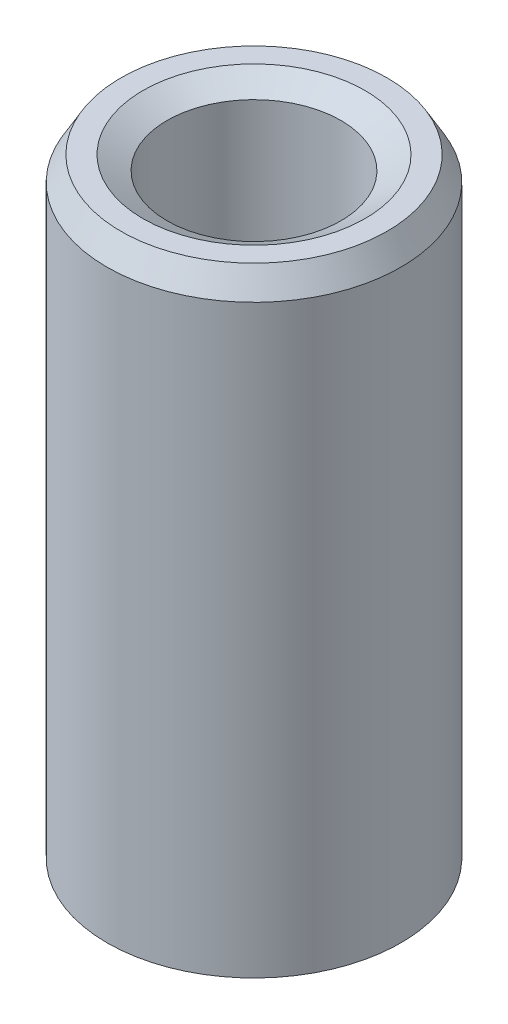
ISO-10303-21;
HEADER;
FILE_DESCRIPTION(('STEP AP214'),'2;1');
FILE_NAME('part.step','',(''),(''),'','','');
FILE_SCHEMA(('AUTOMOTIVE_DESIGN { 1 0 10303 214 1 1 1 1 }'));
ENDSEC;
DATA;
#1=APPLICATION_CONTEXT('core data for automotive mechanical design processes');
#2=APPLICATION_PROTOCOL_DEFINITION('international standard','automotive_design',2000,#1);
#3=PRODUCT_CONTEXT('',#1,'mechanical');
#4=PRODUCT('Part','Part','',(#3));
#5=PRODUCT_RELATED_PRODUCT_CATEGORY('part','',(#4));
#6=PRODUCT_DEFINITION_FORMATION('','',#4);
#7=PRODUCT_DEFINITION_CONTEXT('part definition',#1,'design');
#8=PRODUCT_DEFINITION('design','',#6,#7);
#9=PRODUCT_DEFINITION_SHAPE('','',#8);
#10=(LENGTH_UNIT() NAMED_UNIT(*) SI_UNIT(.MILLI.,.METRE.));
#11=(NAMED_UNIT(*) PLANE_ANGLE_UNIT() SI_UNIT($,.RADIAN.));
#12=(NAMED_UNIT(*) SI_UNIT($,.STERADIAN.) SOLID_ANGLE_UNIT());
#13=UNCERTAINTY_MEASURE_WITH_UNIT(LENGTH_MEASURE(1.E-05),#10,'distance_accuracy_value','');
#14=(GEOMETRIC_REPRESENTATION_CONTEXT(3) GLOBAL_UNCERTAINTY_ASSIGNED_CONTEXT((#13)) GLOBAL_UNIT_ASSIGNED_CONTEXT((#10,
#11,#12)) REPRESENTATION_CONTEXT('',''));
#15=CARTESIAN_POINT('',(0.,0.,0.));
#16=DIRECTION('',(0.,0.,1.));
#17=DIRECTION('',(1.,0.,0.));
#18=AXIS2_PLACEMENT_3D('',#15,#16,#17);
#19=CARTESIAN_POINT('',(0.,74.2111872431679,0.));
#20=DIRECTION('',(0.,-1.,0.));
#21=DIRECTION('',(0.,0.,-1.));
#22=AXIS2_PLACEMENT_3D('',#19,#20,#21);
#23=CYLINDRICAL_SURFACE('',#22,17.5);
#24=CARTESIAN_POINT('',(0.,1.65583119187547,0.));
#25=DIRECTION('',(0.,1.,0.));
#26=DIRECTION('',(0.,0.,1.));
#27=AXIS2_PLACEMENT_3D('',#24,#25,#26);
#28=CIRCLE('',#27,17.5);
#29=CARTESIAN_POINT('',(0.,1.65583119187547,17.5));
#30=VERTEX_POINT('',#29);
#31=EDGE_CURVE('E10',#30,#30,#28,.T.);
#32=ORIENTED_EDGE('',*,*,#31,.T.);
#33=EDGE_LOOP('',(#32));
#34=FACE_BOUND('',#33,.T.);
#35=CARTESIAN_POINT('',(0.,71.3432034900822,0.));
#36=DIRECTION('',(0.,1.,0.));
#37=DIRECTION('',(0.,0.,1.));
#38=AXIS2_PLACEMENT_3D('',#35,#36,#37);
#39=CIRCLE('',#38,17.5);
#40=CARTESIAN_POINT('',(0.,71.3432034900822,-17.5));
#41=VERTEX_POINT('',#40);
#42=EDGE_CURVE('E50',#41,#41,#39,.F.);
#43=ORIENTED_EDGE('',*,*,#42,.T.);
#44=EDGE_LOOP('',(#43));
#45=FACE_BOUND('',#44,.T.);
#46=ADVANCED_FACE('F39',(#34,#45),#23,.T.);
#47=CARTESIAN_POINT('',(0.,74.2111872431679,0.));
#48=DIRECTION('',(0.,1.,0.));
#49=DIRECTION('',(0.,0.,1.));
#50=AXIS2_PLACEMENT_3D('',#47,#48,#49);
#51=PLANE('',#50);
#52=CARTESIAN_POINT('',(0.,74.2111872431679,0.));
#53=DIRECTION('',(0.,1.,0.));
#54=DIRECTION('',(0.,0.,1.));
#55=AXIS2_PLACEMENT_3D('',#52,#53,#54);
#56=CIRCLE('',#55,13.2239791089831);
#57=CARTESIAN_POINT('',(0.,74.2111872431679,13.2239791089831));
#58=VERTEX_POINT('',#57);
#59=EDGE_CURVE('E58',#58,#58,#56,.F.);
#60=ORIENTED_EDGE('',*,*,#59,.T.);
#61=EDGE_LOOP('',(#60));
#62=FACE_BOUND('',#61,.T.);
#63=CARTESIAN_POINT('',(0.,74.2111872431679,0.));
#64=DIRECTION('',(0.,1.,0.));
#65=DIRECTION('',(0.,0.,1.));
#66=AXIS2_PLACEMENT_3D('',#63,#64,#65);
#67=CIRCLE('',#66,15.8441688081245);
#68=CARTESIAN_POINT('',(0.,74.2111872431679,-15.8441688081245));
#69=VERTEX_POINT('',#68);
#70=EDGE_CURVE('E61',#69,#69,#67,.T.);
#71=ORIENTED_EDGE('',*,*,#70,.T.);
#72=EDGE_LOOP('',(#71));
#73=FACE_BOUND('',#72,.T.);
#74=ADVANCED_FACE('F88',(#62,#73),#51,.T.);
#75=CARTESIAN_POINT('',(0.,0.,0.));
#76=DIRECTION('',(0.,1.,0.));
#77=DIRECTION('',(0.,0.,1.));
#78=AXIS2_PLACEMENT_3D('',#75,#76,#77);
#79=PLANE('',#78);
#80=CARTESIAN_POINT('',(0.,0.,0.));
#81=DIRECTION('',(0.,1.,0.));
#82=DIRECTION('',(0.,0.,1.));
#83=AXIS2_PLACEMENT_3D('',#80,#81,#82);
#84=CIRCLE('',#83,12.0118265477729);
#85=CARTESIAN_POINT('',(0.,0.,12.0118265477729));
#86=VERTEX_POINT('',#85);
#87=EDGE_CURVE('E51',#86,#86,#84,.T.);
#88=ORIENTED_EDGE('',*,*,#87,.T.);
#89=EDGE_LOOP('',(#88));
#90=FACE_BOUND('',#89,.T.);
#91=CARTESIAN_POINT('',(0.,0.,0.));
#92=DIRECTION('',(0.,1.,0.));
#93=DIRECTION('',(0.,0.,1.));
#94=AXIS2_PLACEMENT_3D('',#91,#92,#93);
#95=CIRCLE('',#94,14.6320162469143);
#96=CARTESIAN_POINT('',(0.,0.,14.6320162469143));
#97=VERTEX_POINT('',#96);
#98=EDGE_CURVE('E54',#97,#97,#95,.F.);
#99=ORIENTED_EDGE('',*,*,#98,.T.);
#100=EDGE_LOOP('',(#99));
#101=FACE_BOUND('',#100,.T.);
#102=ADVANCED_FACE('F83',(#90,#101),#79,.F.);
#103=CARTESIAN_POINT('',(0.,74.2111872431679,0.));
#104=DIRECTION('',(0.,-1.,0.));
#105=DIRECTION('',(0.,0.,-1.));
#106=AXIS2_PLACEMENT_3D('',#103,#104,#105);
#107=CYLINDRICAL_SURFACE('',#106,10.3559953558974);
#108=CARTESIAN_POINT('',(0.,72.5553560512925,0.));
#109=DIRECTION('',(0.,1.,0.));
#110=DIRECTION('',(0.,0.,1.));
#111=AXIS2_PLACEMENT_3D('',#108,#109,#110);
#112=CIRCLE('',#111,10.3559953558974);
#113=CARTESIAN_POINT('',(0.,72.5553560512925,10.3559953558974));
#114=VERTEX_POINT('',#113);
#115=EDGE_CURVE('E67',#114,#114,#112,.T.);
#116=ORIENTED_EDGE('',*,*,#115,.T.);
#117=EDGE_LOOP('',(#116));
#118=FACE_BOUND('',#117,.T.);
#119=CARTESIAN_POINT('',(0.,2.86798375308568,0.));
#120=DIRECTION('',(0.,1.,0.));
#121=DIRECTION('',(0.,0.,1.));
#122=AXIS2_PLACEMENT_3D('',#119,#120,#121);
#123=CIRCLE('',#122,10.3559953558974);
#124=CARTESIAN_POINT('',(0.,2.86798375308568,10.3559953558974));
#125=VERTEX_POINT('',#124);
#126=EDGE_CURVE('E69',#125,#125,#123,.F.);
#127=ORIENTED_EDGE('',*,*,#126,.T.);
#128=EDGE_LOOP('',(#127));
#129=FACE_BOUND('',#128,.T.);
#130=ADVANCED_FACE('F71',(#118,#129),#107,.F.);
#131=CARTESIAN_POINT('',(0.,72.5553560512925,0.));
#132=DIRECTION('',(0.,1.,0.));
#133=DIRECTION('',(0.,0.,1.));
#134=AXIS2_PLACEMENT_3D('',#131,#132,#133);
#135=CONICAL_SURFACE('',#134,10.3559953558974,1.0471975511966);
#136=ORIENTED_EDGE('',*,*,#59,.F.);
#137=EDGE_LOOP('',(#136));
#138=FACE_BOUND('',#137,.T.);
#139=ORIENTED_EDGE('',*,*,#115,.F.);
#140=EDGE_LOOP('',(#139));
#141=FACE_BOUND('',#140,.T.);
#142=ADVANCED_FACE('F77',(#138,#141),#135,.F.);
#143=CARTESIAN_POINT('',(0.,0.,0.));
#144=DIRECTION('',(0.,-1.,0.));
#145=DIRECTION('',(0.,0.,-1.));
#146=AXIS2_PLACEMENT_3D('',#143,#144,#145);
#147=CONICAL_SURFACE('',#146,12.0118265477729,0.523598775598294);
#148=ORIENTED_EDGE('',*,*,#126,.F.);
#149=EDGE_LOOP('',(#148));
#150=FACE_BOUND('',#149,.T.);
#151=ORIENTED_EDGE('',*,*,#87,.F.);
#152=EDGE_LOOP('',(#151));
#153=FACE_BOUND('',#152,.T.);
#154=ADVANCED_FACE('F73',(#150,#153),#147,.F.);
#155=CARTESIAN_POINT('',(0.,1.65583119187547,0.));
#156=DIRECTION('',(0.,1.,0.));
#157=DIRECTION('',(0.,0.,1.));
#158=AXIS2_PLACEMENT_3D('',#155,#156,#157);
#159=CONICAL_SURFACE('',#158,17.5,1.0471975511966);
#160=ORIENTED_EDGE('',*,*,#98,.F.);
#161=EDGE_LOOP('',(#160));
#162=FACE_BOUND('',#161,.T.);
#163=ORIENTED_EDGE('',*,*,#31,.F.);
#164=EDGE_LOOP('',(#163));
#165=FACE_BOUND('',#164,.T.);
#166=ADVANCED_FACE('F76',(#162,#165),#159,.T.);
#167=CARTESIAN_POINT('',(0.,74.2111872431679,0.));
#168=DIRECTION('',(0.,-1.,0.));
#169=DIRECTION('',(0.,0.,-1.));
#170=AXIS2_PLACEMENT_3D('',#167,#168,#169);
#171=CONICAL_SURFACE('',#170,15.8441688081245,0.523598775598296);
#172=CARTESIAN_POINT('',(0.,71.3432034900822,-17.5));
#173=CARTESIAN_POINT('',(0.,71.3730783208435,-17.482751758418));
#174=CARTESIAN_POINT('',(0.,71.4029531516049,-17.4655035168359));
#175=CARTESIAN_POINT('',(0.,71.4627028131275,-17.4310070336719));
#176=CARTESIAN_POINT('',(0.,71.4925776438888,-17.4137587920898));
#177=CARTESIAN_POINT('',(0.,71.5523273054114,-17.3792623089258));
#178=CARTESIAN_POINT('',(0.,71.5822021361727,-17.3620140673437));
#179=CARTESIAN_POINT('',(0.,71.6419517976953,-17.3275175841796));
#180=CARTESIAN_POINT('',(0.,71.6718266284566,-17.3102693425976));
#181=CARTESIAN_POINT('',(0.,71.7315762899793,-17.2757728594335));
#182=CARTESIAN_POINT('',(0.,71.7614511207406,-17.2585246178515));
#183=CARTESIAN_POINT('',(0.,71.8212007822632,-17.2240281346874));
#184=CARTESIAN_POINT('',(0.,71.8510756130245,-17.2067798931054));
#185=CARTESIAN_POINT('',(0.,71.9108252745471,-17.1722834099413));
#186=CARTESIAN_POINT('',(0.,71.9407001053084,-17.1550351683593));
#187=CARTESIAN_POINT('',(0.,72.000449766831,-17.1205386851952));
#188=CARTESIAN_POINT('',(0.,72.0303245975924,-17.1032904436132));
#189=CARTESIAN_POINT('',(0.,72.090074259115,-17.0687939604491));
#190=CARTESIAN_POINT('',(0.,72.1199490898763,-17.0515457188671));
#191=CARTESIAN_POINT('',(0.,72.1796987513989,-17.017049235703));
#192=CARTESIAN_POINT('',(0.,72.2095735821602,-16.999800994121));
#193=CARTESIAN_POINT('',(0.,72.2693232436828,-16.9653045109569));
#194=CARTESIAN_POINT('',(0.,72.2991980744441,-16.9480562693748));
#195=CARTESIAN_POINT('',(0.,72.3589477359668,-16.9135597862108));
#196=CARTESIAN_POINT('',(0.,72.3888225667281,-16.8963115446287));
#197=CARTESIAN_POINT('',(0.,72.4485722282507,-16.8618150614647));
#198=CARTESIAN_POINT('',(0.,72.478447059012,-16.8445668198826));
#199=CARTESIAN_POINT('',(0.,72.5381967205346,-16.8100703367186));
#200=CARTESIAN_POINT('',(0.,72.5680715512959,-16.7928220951365));
#201=CARTESIAN_POINT('',(0.,72.6278212128185,-16.7583256119724));
#202=CARTESIAN_POINT('',(0.,72.6576960435799,-16.7410773703904));
#203=CARTESIAN_POINT('',(0.,72.7174457051025,-16.7065808872263));
#204=CARTESIAN_POINT('',(0.,72.7473205358638,-16.6893326456443));
#205=CARTESIAN_POINT('',(0.,72.8070701973864,-16.6548361624802));
#206=CARTESIAN_POINT('',(0.,72.8369450281477,-16.6375879208982));
#207=CARTESIAN_POINT('',(0.,72.8966946896703,-16.6030914377341));
#208=CARTESIAN_POINT('',(0.,72.9265695204316,-16.5858431961521));
#209=CARTESIAN_POINT('',(0.,72.9863191819543,-16.551346712988));
#210=CARTESIAN_POINT('',(0.,73.0161940127156,-16.534098471406));
#211=CARTESIAN_POINT('',(0.,73.0759436742382,-16.4996019882419));
#212=CARTESIAN_POINT('',(0.,73.1058185049995,-16.4823537466599));
#213=CARTESIAN_POINT('',(0.,73.1655681665221,-16.4478572634958));
#214=CARTESIAN_POINT('',(0.,73.1954429972834,-16.4306090219138));
#215=CARTESIAN_POINT('',(0.,73.255192658806,-16.3961125387497));
#216=CARTESIAN_POINT('',(0.,73.2850674895674,-16.3788642971676));
#217=CARTESIAN_POINT('',(0.,73.34481715109,-16.3443678140036));
#218=CARTESIAN_POINT('',(0.,73.3746919818513,-16.3271195724215));
#219=CARTESIAN_POINT('',(0.,73.4344416433739,-16.2926230892575));
#220=CARTESIAN_POINT('',(0.,73.4643164741352,-16.2753748476754));
#221=CARTESIAN_POINT('',(0.,73.5240661356578,-16.2408783645114));
#222=CARTESIAN_POINT('',(0.,73.5539409664191,-16.2236301229293));
#223=CARTESIAN_POINT('',(0.,73.6136906279418,-16.1891336397652));
#224=CARTESIAN_POINT('',(0.,73.6435654587031,-16.1718853981832));
#225=CARTESIAN_POINT('',(0.,73.7033151202257,-16.1373889150191));
#226=CARTESIAN_POINT('',(0.,73.733189950987,-16.1201406734371));
#227=CARTESIAN_POINT('',(0.,73.7929396125096,-16.085644190273));
#228=CARTESIAN_POINT('',(0.,73.8228144432709,-16.068395948691));
#229=CARTESIAN_POINT('',(0.,73.8825641047935,-16.0338994655269));
#230=CARTESIAN_POINT('',(0.,73.9124389355548,-16.0166512239449));
#231=CARTESIAN_POINT('',(0.,73.9721885970774,-15.9821547407808));
#232=CARTESIAN_POINT('',(0.,74.0020634278388,-15.9649064991988));
#233=CARTESIAN_POINT('',(0.,74.0618130893614,-15.9304100160347));
#234=CARTESIAN_POINT('',(0.,74.0916879201227,-15.9131617744527));
#235=CARTESIAN_POINT('',(0.,74.1514375816453,-15.8786652912886));
#236=CARTESIAN_POINT('',(0.,74.1813124124066,-15.8614170497066));
#237=CARTESIAN_POINT('',(0.,74.2111872431679,-15.8441688081245));
#238=B_SPLINE_CURVE_WITH_KNOTS('',3,(#172,#173,#174,#175,#176,#177,#178,#179,#180,#181,#182,
#183,#184,#185,#186,#187,#188,#189,#190,#191,#192,#193,#194,#195,#196,#197,#198,#199,#200,#201,
#202,#203,#204,#205,#206,#207,#208,#209,#210,#211,#212,#213,#214,#215,#216,#217,#218,#219,#220,
#221,#222,#223,#224,#225,#226,#227,#228,#229,#230,#231,#232,#233,#234,#235,#236,#237),
.UNSPECIFIED.,.F.,.F.,(4,2,2,2,2,2,2,2,2,2,2,2,2,2,2,2,2,2,2,2,2,2,2,2,2,2,2,2,2,2,2,2,4),(0.,
0.103489449492221,0.206978898984444,0.310468348476666,0.413957797968877,0.5174472474611,
0.620936696953321,0.724426146445531,0.827915595937754,0.931405045429977,1.03489449492219,
1.13838394441441,1.24187339390663,1.34536284339884,1.44885229289106,1.55234174238329,
1.6558311918755,1.75932064136772,1.86281009085994,1.96629954035216,2.06978898984437,
2.1732784393366,2.27676788882882,2.38025733832103,2.48374678781325,2.58723623730547,
2.69072568679768,2.79421513628991,2.89770458578213,3.00119403527434,3.10468348476656,
3.20817293425878,3.311662383751),.UNSPECIFIED.);
#239=EDGE_CURVE('BSEAM45',#41,#69,#238,.T.);
#240=ORIENTED_EDGE('',*,*,#42,.F.);
#241=ORIENTED_EDGE('',*,*,#70,.F.);
#242=ORIENTED_EDGE('',*,*,#239,.T.);
#243=ORIENTED_EDGE('',*,*,#239,.F.);
#244=EDGE_LOOP('',(#240,#242,#241,#243));
#245=FACE_BOUND('',#244,.T.);
#246=ADVANCED_FACE('F45',(#245),#171,.T.);
#247=CLOSED_SHELL('',(#46,#74,#102,#130,#142,#154,#166,#246));
#248=MANIFOLD_SOLID_BREP('B2',#247);
#249=ADVANCED_BREP_SHAPE_REPRESENTATION('',(#18,#248),#14);
#250=SHAPE_DEFINITION_REPRESENTATION(#9,#249);
ENDSEC;
END-ISO-10303-21;
